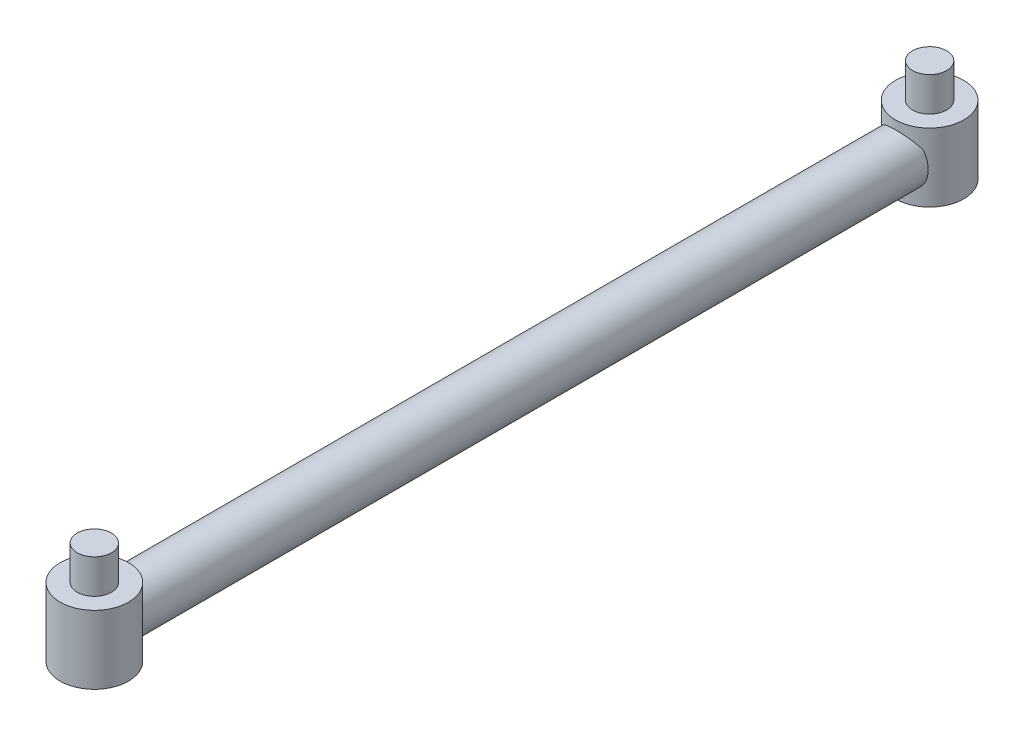
ISO-10303-21;
HEADER;
FILE_DESCRIPTION(('STEP AP214'),'2;1');
FILE_NAME('part.step','',(''),(''),'','','');
FILE_SCHEMA(('AUTOMOTIVE_DESIGN { 1 0 10303 214 1 1 1 1 }'));
ENDSEC;
DATA;
#1=APPLICATION_CONTEXT('core data for automotive mechanical design processes');
#2=APPLICATION_PROTOCOL_DEFINITION('international standard','automotive_design',2000,#1);
#3=PRODUCT_CONTEXT('',#1,'mechanical');
#4=PRODUCT('Part','Part','',(#3));
#5=PRODUCT_RELATED_PRODUCT_CATEGORY('part','',(#4));
#6=PRODUCT_DEFINITION_FORMATION('','',#4);
#7=PRODUCT_DEFINITION_CONTEXT('part definition',#1,'design');
#8=PRODUCT_DEFINITION('design','',#6,#7);
#9=PRODUCT_DEFINITION_SHAPE('','',#8);
#10=(LENGTH_UNIT() NAMED_UNIT(*) SI_UNIT(.MILLI.,.METRE.));
#11=(NAMED_UNIT(*) PLANE_ANGLE_UNIT() SI_UNIT($,.RADIAN.));
#12=(NAMED_UNIT(*) SI_UNIT($,.STERADIAN.) SOLID_ANGLE_UNIT());
#13=UNCERTAINTY_MEASURE_WITH_UNIT(LENGTH_MEASURE(1.E-05),#10,'distance_accuracy_value','');
#14=(GEOMETRIC_REPRESENTATION_CONTEXT(3) GLOBAL_UNCERTAINTY_ASSIGNED_CONTEXT((#13)) GLOBAL_UNIT_ASSIGNED_CONTEXT((#10,
#11,#12)) REPRESENTATION_CONTEXT('',''));
#15=CARTESIAN_POINT('',(0.,0.,0.));
#16=DIRECTION('',(0.,0.,1.));
#17=DIRECTION('',(1.,0.,0.));
#18=AXIS2_PLACEMENT_3D('',#15,#16,#17);
#19=CARTESIAN_POINT('',(0.,0.,0.));
#20=DIRECTION('',(0.,0.,1.));
#21=DIRECTION('',(1.,0.,0.));
#22=AXIS2_PLACEMENT_3D('',#19,#20,#21);
#23=PLANE('',#22);
#24=CARTESIAN_POINT('',(0.,0.,0.));
#25=DIRECTION('',(0.,0.,1.));
#26=DIRECTION('',(1.,0.,0.));
#27=AXIS2_PLACEMENT_3D('',#24,#25,#26);
#28=CIRCLE('',#27,1.5);
#29=CARTESIAN_POINT('',(1.22385806449171,-0.867278177967484,0.));
#30=VERTEX_POINT('',#29);
#31=CARTESIAN_POINT('',(1.22385806449252,0.867278177967211,-5.97100689130873E-13));
#32=VERTEX_POINT('',#31);
#33=EDGE_CURVE('E71',#30,#32,#28,.T.);
#34=ORIENTED_EDGE('',*,*,#33,.F.);
#35=DIRECTION('',(0.,1.,0.));
#36=VECTOR('',#35,1.);
#37=CARTESIAN_POINT('',(1.22385806449171,-2.,0.));
#38=LINE('',#37,#36);
#39=EDGE_CURVE('E39',#30,#32,#38,.T.);
#40=ORIENTED_EDGE('',*,*,#39,.T.);
#41=EDGE_LOOP('',(#34,#40));
#42=FACE_BOUND('',#41,.T.);
#43=ADVANCED_FACE('F34',(#42),#23,.F.);
#44=CARTESIAN_POINT('',(0.,-2.,47.2380359702391));
#45=DIRECTION('',(0.,1.,0.));
#46=DIRECTION('',(0.,0.,1.));
#47=AXIS2_PLACEMENT_3D('',#44,#45,#46);
#48=CYLINDRICAL_SURFACE('',#47,2.);
#49=CARTESIAN_POINT('',(0.,-2.,47.2380359702391));
#50=DIRECTION('',(0.,1.,0.));
#51=DIRECTION('',(0.,0.,1.));
#52=AXIS2_PLACEMENT_3D('',#49,#50,#51);
#53=CIRCLE('',#52,2.);
#54=CARTESIAN_POINT('',(0.,-2.,49.2380359702391));
#55=VERTEX_POINT('',#54);
#56=EDGE_CURVE('E86',#55,#55,#53,.T.);
#57=ORIENTED_EDGE('',*,*,#56,.T.);
#58=EDGE_LOOP('',(#57));
#59=FACE_BOUND('',#58,.T.);
#60=CARTESIAN_POINT('',(0.,2.,47.2380359702391));
#61=DIRECTION('',(0.,1.,0.));
#62=DIRECTION('',(0.,0.,1.));
#63=AXIS2_PLACEMENT_3D('',#60,#61,#62);
#64=CIRCLE('',#63,2.);
#65=CARTESIAN_POINT('',(0.,2.,49.2380359702391));
#66=VERTEX_POINT('',#65);
#67=EDGE_CURVE('E79',#66,#66,#64,.T.);
#68=ORIENTED_EDGE('',*,*,#67,.F.);
#69=EDGE_LOOP('',(#68));
#70=FACE_BOUND('',#69,.T.);
#71=CARTESIAN_POINT('',(-1.5,0.,45.9151603147068));
#72=CARTESIAN_POINT('',(-1.49999219049447,0.0699974234256294,45.9151440697981));
#73=CARTESIAN_POINT('',(-1.4950410907442,0.140045834311918,45.9094723040849));
#74=CARTESIAN_POINT('',(-1.47578333210409,0.27732985620948,45.888129529911));
#75=CARTESIAN_POINT('',(-1.46144878565587,0.344556445019508,45.8724287185523));
#76=CARTESIAN_POINT('',(-1.42483838991846,0.473579846738377,45.8342846910704));
#77=CARTESIAN_POINT('',(-1.40267483444956,0.535438776762464,45.8119374877909));
#78=CARTESIAN_POINT('',(-1.35130655299363,0.654345454445194,45.7631714199264));
#79=CARTESIAN_POINT('',(-1.3221026780169,0.711393782469219,45.7367530475897));
#80=CARTESIAN_POINT('',(-1.25039909811054,0.832112796316594,45.6762628406276));
#81=CARTESIAN_POINT('',(-1.20639573950363,0.894667934226478,45.6417469301412));
#82=CARTESIAN_POINT('',(-1.10933596759308,1.01252546624227,45.5728243292753));
#83=CARTESIAN_POINT('',(-1.05626622282799,1.06781696482027,45.5384178768403));
#84=CARTESIAN_POINT('',(-0.929610192252514,1.18085873865547,45.4654101458766));
#85=CARTESIAN_POINT('',(-0.854047289142164,1.23680596671985,45.4273867579415));
#86=CARTESIAN_POINT('',(-0.691189714821941,1.33462220828284,45.3592078727227));
#87=CARTESIAN_POINT('',(-0.603923293836167,1.37652429746881,45.329033928438));
#88=CARTESIAN_POINT('',(-0.447869023983644,1.43320768590294,45.2876933803366));
#89=CARTESIAN_POINT('',(-0.381446049692535,1.45235709597847,45.273538861029));
#90=CARTESIAN_POINT('',(-0.245552609316541,1.48139011599675,45.2519796108635));
#91=CARTESIAN_POINT('',(-0.176084845995168,1.49128177610674,45.2445690159154));
#92=CARTESIAN_POINT('',(-0.0358650926220255,1.50122173386249,45.2371222144582));
#93=CARTESIAN_POINT('',(0.0348897591186414,1.50124445437644,45.2371051696641));
#94=CARTESIAN_POINT('',(0.175316156674039,1.49138206321971,45.2444939052084));
#95=CARTESIAN_POINT('',(0.244987447822229,1.48149465709186,45.2519014045257));
#96=CARTESIAN_POINT('',(0.378889193792654,1.45291894941013,45.2731221907949));
#97=CARTESIAN_POINT('',(0.443224268236298,1.43454367361292,45.2867073925823));
#98=CARTESIAN_POINT('',(0.567680485046399,1.39000435781776,45.3192131836689));
#99=CARTESIAN_POINT('',(0.627800705033637,1.36383861948684,45.3381349362971));
#100=CARTESIAN_POINT('',(0.749216921864732,1.30147038485468,45.382425510394));
#101=CARTESIAN_POINT('',(0.809935384713601,1.26448790338124,45.4082705641581));
#102=CARTESIAN_POINT('',(0.924567250548287,1.18326629602948,45.4634289454017));
#103=CARTESIAN_POINT('',(0.978474784621224,1.1390209863001,45.4927452224345));
#104=CARTESIAN_POINT('',(1.08908204283329,1.03477665117906,45.5590983115155));
#105=CARTESIAN_POINT('',(1.14424493004784,0.9733907899736,45.5965194115754));
#106=CARTESIAN_POINT('',(1.24400875556228,0.842165416378053,45.6707763874014));
#107=CARTESIAN_POINT('',(1.28860466211477,0.772321900474934,45.7076119766038));
#108=CARTESIAN_POINT('',(1.35873206411601,0.639018129754369,45.7698417102475));
#109=CARTESIAN_POINT('',(1.38628866868103,0.577012954699347,45.7960599723392));
#110=CARTESIAN_POINT('',(1.43319397108784,0.447934718580615,45.8426685576651));
#111=CARTESIAN_POINT('',(1.45256121808259,0.380873520309629,45.8630720170339));
#112=CARTESIAN_POINT('',(1.47902385350669,0.256313056001673,45.8916354640367));
#113=CARTESIAN_POINT('',(1.48779069496582,0.199552917883135,45.9014205746704));
#114=CARTESIAN_POINT('',(1.49871760619789,0.0846445338261694,45.9136800858557));
#115=CARTESIAN_POINT('',(1.50088612873265,0.0264981600971747,45.916163839656));
#116=CARTESIAN_POINT('',(1.49845270115552,-0.0894789917334012,45.9134072823341));
#117=CARTESIAN_POINT('',(1.4938482589949,-0.147309645809676,45.9081641281674));
#118=CARTESIAN_POINT('',(1.47822527271969,-0.261076152442875,45.8908237824886));
#119=CARTESIAN_POINT('',(1.46719578056394,-0.317008597948105,45.8787148929656));
#120=CARTESIAN_POINT('',(1.43413959562387,-0.446338044938873,45.843758387361));
#121=CARTESIAN_POINT('',(1.40954189769242,-0.518435953915031,45.8185877332659));
#122=CARTESIAN_POINT('',(1.35088877838435,-0.656307663640119,45.7626573594393));
#123=CARTESIAN_POINT('',(1.31681594335476,-0.722069517294752,45.7318873854668));
#124=CARTESIAN_POINT('',(1.23869774116696,-0.849349008048126,45.6669531464826));
#125=CARTESIAN_POINT('',(1.19434110060341,-0.910632876218262,45.6327071317786));
#126=CARTESIAN_POINT('',(1.09682562914592,-1.02600209636125,45.5645609075154));
#127=CARTESIAN_POINT('',(1.04366252194463,-1.08008392798894,45.5306608744924));
#128=CARTESIAN_POINT('',(0.916234513829615,-1.19127699162937,45.4584337440037));
#129=CARTESIAN_POINT('',(0.83989627094685,-1.2464752388576,45.4207542285855));
#130=CARTESIAN_POINT('',(0.675551612651262,-1.34262073345087,45.3535049225408));
#131=CARTESIAN_POINT('',(0.587571029974847,-1.38359882458129,45.3239176097162));
#132=CARTESIAN_POINT('',(0.430755661496907,-1.43843799144687,45.2838419062153));
#133=CARTESIAN_POINT('',(0.364250057327468,-1.45675679327544,45.2702811899427));
#134=CARTESIAN_POINT('',(0.228364464964347,-1.48412879630752,45.2499333143478));
#135=CARTESIAN_POINT('',(0.158987104561937,-1.49319028154851,45.2431400991695));
#136=CARTESIAN_POINT('',(0.0191476059403933,-1.5015163909286,45.2369003030684));
#137=CARTESIAN_POINT('',(-0.051316692587093,-1.50075801734825,45.23747096805));
#138=CARTESIAN_POINT('',(-0.191009011030087,-1.48943900869876,45.2459479378009));
#139=CARTESIAN_POINT('',(-0.260236696591295,-1.47887576229252,45.2538561967955));
#140=CARTESIAN_POINT('',(-0.393521935254978,-1.44902508383276,45.2760019609871));
#141=CARTESIAN_POINT('',(-0.457671236511448,-1.42999981867845,45.2900490623103));
#142=CARTESIAN_POINT('',(-0.581661343097394,-1.38421193438106,45.3234087644877));
#143=CARTESIAN_POINT('',(-0.64150122338882,-1.35744766016908,45.3427224916152));
#144=CARTESIAN_POINT('',(-0.762547698766817,-1.29372206240403,45.3878595481327));
#145=CARTESIAN_POINT('',(-0.823141236713421,-1.25594906864041,45.4141724431632));
#146=CARTESIAN_POINT('',(-0.937414811724218,-1.17313355944579,45.4701809094819));
#147=CARTESIAN_POINT('',(-0.991088412383378,-1.12808436271395,45.4998795822825));
#148=CARTESIAN_POINT('',(-1.10112380660682,-1.0219946334392,45.566972439818));
#149=CARTESIAN_POINT('',(-1.15591691541996,-0.959553600560088,45.6047267451921));
#150=CARTESIAN_POINT('',(-1.25475253429351,-0.826131928100118,45.6793751456057));
#151=CARTESIAN_POINT('',(-1.29879110556729,-0.755148173963429,45.7162689210201));
#152=CARTESIAN_POINT('',(-1.36695971301455,-0.621116749409687,45.7775399557462));
#153=CARTESIAN_POINT('',(-1.39333526337998,-0.559665017293436,45.8028997201627));
#154=CARTESIAN_POINT('',(-1.43805398028599,-0.431917086944114,45.8477103237267));
#155=CARTESIAN_POINT('',(-1.45641847678344,-0.365634308404543,45.8671768112421));
#156=CARTESIAN_POINT('',(-1.4799705775638,-0.249211780403065,45.8927117364064));
#157=CARTESIAN_POINT('',(-1.48744249026867,-0.200032928709532,45.9010346675823));
#158=CARTESIAN_POINT('',(-1.49745839072448,-0.100577666966344,45.9122630163145));
#159=CARTESIAN_POINT('',(-1.50000561211714,-0.0503019990562725,45.9151719887276));
#160=CARTESIAN_POINT('',(-1.5,0.,45.9151603147068));
#161=B_SPLINE_CURVE_WITH_KNOTS('',3,(#71,#72,#73,#74,#75,#76,#77,#78,#79,#80,#81,#82,#83,#84,
#85,#86,#87,#88,#89,#90,#91,#92,#93,#94,#95,#96,#97,#98,#99,#100,#101,#102,#103,#104,#105,#106,
#107,#108,#109,#110,#111,#112,#113,#114,#115,#116,#117,#118,#119,#120,#121,#122,#123,#124,#125,
#126,#127,#128,#129,#130,#131,#132,#133,#134,#135,#136,#137,#138,#139,#140,#141,#142,#143,#144,
#145,#146,#147,#148,#149,#150,#151,#152,#153,#154,#155,#156,#157,#158,#159,#160),.UNSPECIFIED.,
.T.,.F.,(4,2,2,2,2,2,2,2,2,2,2,2,2,2,2,2,2,2,2,2,2,2,2,2,2,2,2,2,2,2,2,2,2,2,2,2,2,2,2,2,2,2,2,
2,4),(0.,0.20973177668449,0.420089722582994,0.627545385620138,0.834975984672346,
1.08585208691169,1.33710031031849,1.63964848103538,1.94147907444963,2.15227725277555,
2.36289195870711,2.57405250727807,2.78526195641288,2.9892375589505,3.19325766108669,
3.41936844116895,3.64567274887663,3.91649517204702,4.18744629647933,4.40499409477197,
4.62204646613006,4.79608005545901,4.96989060538193,5.14376512326213,5.31793678696019,
5.55730028202397,5.79710662639151,6.04543209090061,6.29387849446619,6.59652499511463,
6.89851088586565,7.10852896194427,7.31835893539181,7.52868041101044,7.73905791773945,
7.94332812691913,8.14764205379333,8.3751005248961,8.60276905744645,8.87547580578156,
9.14828228208532,9.36218279640836,9.57551025772699,9.72632812073767,9.87704692032409),.UNSPECIFIED.);
#162=CARTESIAN_POINT('',(-1.5,0.,45.9151603147068));
#163=VERTEX_POINT('',#162);
#164=EDGE_CURVE('E76',#163,#163,#161,.T.);
#165=ORIENTED_EDGE('',*,*,#164,.F.);
#166=EDGE_LOOP('',(#165));
#167=FACE_BOUND('',#166,.T.);
#168=ADVANCED_FACE('F87',(#59,#70,#167),#48,.T.);
#169=CARTESIAN_POINT('',(0.,-2.,47.2380359702391));
#170=DIRECTION('',(0.,1.,0.));
#171=DIRECTION('',(0.,0.,1.));
#172=AXIS2_PLACEMENT_3D('',#169,#170,#171);
#173=PLANE('',#172);
#174=ORIENTED_EDGE('',*,*,#56,.F.);
#175=EDGE_LOOP('',(#174));
#176=FACE_BOUND('',#175,.T.);
#177=ADVANCED_FACE('F91',(#176),#173,.F.);
#178=CARTESIAN_POINT('',(0.,2.,47.2380359702391));
#179=DIRECTION('',(0.,1.,0.));
#180=DIRECTION('',(0.,0.,1.));
#181=AXIS2_PLACEMENT_3D('',#178,#179,#180);
#182=PLANE('',#181);
#183=CARTESIAN_POINT('',(0.,2.,47.2380359702391));
#184=DIRECTION('',(0.,1.,0.));
#185=DIRECTION('',(0.,0.,1.));
#186=AXIS2_PLACEMENT_3D('',#183,#184,#185);
#187=CIRCLE('',#186,1.);
#188=CARTESIAN_POINT('',(0.,2.,48.2380359702391));
#189=VERTEX_POINT('',#188);
#190=EDGE_CURVE('E44',#189,#189,#187,.T.);
#191=ORIENTED_EDGE('',*,*,#190,.F.);
#192=EDGE_LOOP('',(#191));
#193=FACE_BOUND('',#192,.T.);
#194=ORIENTED_EDGE('',*,*,#67,.T.);
#195=EDGE_LOOP('',(#194));
#196=FACE_BOUND('',#195,.T.);
#197=ADVANCED_FACE('F93',(#193,#196),#182,.T.);
#198=CARTESIAN_POINT('',(0.,0.,46.));
#199=DIRECTION('',(0.,0.,-1.));
#200=DIRECTION('',(-1.,0.,0.));
#201=AXIS2_PLACEMENT_3D('',#198,#199,#200);
#202=CYLINDRICAL_SURFACE('',#201,1.5);
#203=ORIENTED_EDGE('',*,*,#164,.T.);
#204=EDGE_LOOP('',(#203));
#205=FACE_BOUND('',#204,.T.);
#206=CARTESIAN_POINT('',(-1.22385806449171,0.867278177967485,0.));
#207=VERTEX_POINT('',#206);
#208=CARTESIAN_POINT('',(-1.22385806449171,-0.867278177967485,0.));
#209=VERTEX_POINT('',#208);
#210=EDGE_CURVE('E67',#207,#209,#28,.T.);
#211=ORIENTED_EDGE('',*,*,#210,.T.);
#212=CARTESIAN_POINT('',(-1.5,0.,-0.258949694491724));
#213=CARTESIAN_POINT('',(-1.49999219049447,-0.0699974234256293,-0.258933449583069));
#214=CARTESIAN_POINT('',(-1.4950410907442,-0.140045834311918,-0.253261683869851));
#215=CARTESIAN_POINT('',(-1.47578333210409,-0.27732985620948,-0.231918909696));
#216=CARTESIAN_POINT('',(-1.46144878565587,-0.344556445019508,-0.216218098337312));
#217=CARTESIAN_POINT('',(-1.42483838991846,-0.473579846738376,-0.178074070855311));
#218=CARTESIAN_POINT('',(-1.40267483444956,-0.535438776762464,-0.155726867575875));
#219=CARTESIAN_POINT('',(-1.35130655299363,-0.654345454445194,-0.106960799711345));
#220=CARTESIAN_POINT('',(-1.3221026780169,-0.711393782469218,-0.0805424273746976));
#221=CARTESIAN_POINT('',(-1.25039909811054,-0.832112796316593,-0.0200522204125482));
#222=CARTESIAN_POINT('',(-1.20639573950363,-0.894667934226477,0.0144636900738546));
#223=CARTESIAN_POINT('',(-1.10933596759308,-1.01252546624227,0.083386290939769));
#224=CARTESIAN_POINT('',(-1.05626622282799,-1.06781696482027,0.117792743374749));
#225=CARTESIAN_POINT('',(-0.929610192252514,-1.18085873865547,0.190800474338491));
#226=CARTESIAN_POINT('',(-0.854047289142163,-1.23680596671986,0.22882386227357));
#227=CARTESIAN_POINT('',(-0.69118971482194,-1.33462220828284,0.297002747492305));
#228=CARTESIAN_POINT('',(-0.603923293836167,-1.37652429746881,0.327176691777046));
#229=CARTESIAN_POINT('',(-0.447869023983645,-1.43320768590294,0.368517239878465));
#230=CARTESIAN_POINT('',(-0.381446049692536,-1.45235709597847,0.382671759186048));
#231=CARTESIAN_POINT('',(-0.245552609316542,-1.48139011599675,0.404231009351533));
#232=CARTESIAN_POINT('',(-0.176084845995169,-1.49128177610674,0.411641604299623));
#233=CARTESIAN_POINT('',(-0.0358650926220279,-1.50122173386249,0.419088405756851));
#234=CARTESIAN_POINT('',(0.0348897591186387,-1.50124445437644,0.419105450550939));
#235=CARTESIAN_POINT('',(0.175316156674036,-1.49138206321971,0.411716715006643));
#236=CARTESIAN_POINT('',(0.244987447822227,-1.48149465709186,0.404309215689358));
#237=CARTESIAN_POINT('',(0.378889193792651,-1.45291894941013,0.383088429420097));
#238=CARTESIAN_POINT('',(0.443224268236295,-1.43454367361292,0.369503227632784));
#239=CARTESIAN_POINT('',(0.567680485046396,-1.39000435781776,0.336997436546152));
#240=CARTESIAN_POINT('',(0.627800705033635,-1.36383861948684,0.318075683917919));
#241=CARTESIAN_POINT('',(0.74921692186473,-1.30147038485469,0.273785109821028));
#242=CARTESIAN_POINT('',(0.809935384713598,-1.26448790338124,0.247940056056957));
#243=CARTESIAN_POINT('',(0.924567250548283,-1.18326629602949,0.192781674813374));
#244=CARTESIAN_POINT('',(0.97847478462122,-1.1390209863001,0.163465397780519));
#245=CARTESIAN_POINT('',(1.08908204283329,-1.03477665117906,0.0971123086995827));
#246=CARTESIAN_POINT('',(1.14424493004784,-0.973390789973603,0.0596912086396656));
#247=CARTESIAN_POINT('',(1.24400875556228,-0.842165416378057,-0.0145657671863198));
#248=CARTESIAN_POINT('',(1.28860466211477,-0.772321900474938,-0.0514013563887796));
#249=CARTESIAN_POINT('',(1.358732064116,-0.639018129754373,-0.113631090032422));
#250=CARTESIAN_POINT('',(1.38628866868102,-0.577012954699351,-0.139849352124188));
#251=CARTESIAN_POINT('',(1.43319397108784,-0.447934718580619,-0.186457937450075));
#252=CARTESIAN_POINT('',(1.45256121808259,-0.380873520309634,-0.206861396818903));
#253=CARTESIAN_POINT('',(1.47902385350669,-0.256313056001679,-0.235424843821694));
#254=CARTESIAN_POINT('',(1.48779069496582,-0.19955291788314,-0.245209954455313));
#255=CARTESIAN_POINT('',(1.49871760619789,-0.0846445338261743,-0.257469465640675));
#256=CARTESIAN_POINT('',(1.50088612873265,-0.0264981600971796,-0.259953219440942));
#257=CARTESIAN_POINT('',(1.49845270115552,0.0894789917333967,-0.257196662119044));
#258=CARTESIAN_POINT('',(1.4938482589949,0.147309645809671,-0.251953507952376));
#259=CARTESIAN_POINT('',(1.47822527271969,0.261076152442871,-0.234613162273553));
#260=CARTESIAN_POINT('',(1.46719578056394,0.317008597948101,-0.222504272750563));
#261=CARTESIAN_POINT('',(1.43413959562387,0.44633804493887,-0.187547767145997));
#262=CARTESIAN_POINT('',(1.40954189769242,0.518435953915029,-0.162377113050863));
#263=CARTESIAN_POINT('',(1.35088877838435,0.656307663640115,-0.106446739224261));
#264=CARTESIAN_POINT('',(1.31681594335477,0.722069517294747,-0.0756767652517152));
#265=CARTESIAN_POINT('',(1.23869774116696,0.84934900804812,-0.0107425262675194));
#266=CARTESIAN_POINT('',(1.19434110060341,0.910632876218255,0.0235034884364408));
#267=CARTESIAN_POINT('',(1.09682562914592,1.02600209636125,0.0916497126995944));
#268=CARTESIAN_POINT('',(1.04366252194463,1.08008392798894,0.125549745722634));
#269=CARTESIAN_POINT('',(0.916234513829621,1.19127699162936,0.197776876211309));
#270=CARTESIAN_POINT('',(0.839896270946856,1.2464752388576,0.235456391629551));
#271=CARTESIAN_POINT('',(0.675551612651267,1.34262073345087,0.302705697674239));
#272=CARTESIAN_POINT('',(0.587571029974851,1.38359882458129,0.332293010498819));
#273=CARTESIAN_POINT('',(0.43075566149691,1.43843799144687,0.37236871399978));
#274=CARTESIAN_POINT('',(0.364250057327472,1.45675679327544,0.385929430272381));
#275=CARTESIAN_POINT('',(0.228364464964352,1.48412879630752,0.406277305867214));
#276=CARTESIAN_POINT('',(0.158987104561943,1.49319028154851,0.413070521045584));
#277=CARTESIAN_POINT('',(0.019147605940399,1.5015163909286,0.41931031714661));
#278=CARTESIAN_POINT('',(-0.0513166925870873,1.50075801734825,0.418739652165053));
#279=CARTESIAN_POINT('',(-0.19100901103008,1.48943900869876,0.410262682414087));
#280=CARTESIAN_POINT('',(-0.260236696591288,1.47887576229252,0.402354423419493));
#281=CARTESIAN_POINT('',(-0.393521935254971,1.44902508383276,0.380208659227936));
#282=CARTESIAN_POINT('',(-0.457671236511441,1.42999981867845,0.366161557904773));
#283=CARTESIAN_POINT('',(-0.581661343097389,1.38421193438106,0.332801855727347));
#284=CARTESIAN_POINT('',(-0.641501223388814,1.35744766016909,0.313488128599847));
#285=CARTESIAN_POINT('',(-0.762547698766812,1.29372206240403,0.268351072082389));
#286=CARTESIAN_POINT('',(-0.823141236713417,1.25594906864041,0.242038177051794));
#287=CARTESIAN_POINT('',(-0.937414811724214,1.17313355944579,0.186029710733152));
#288=CARTESIAN_POINT('',(-0.991088412383373,1.12808436271395,0.156331037932564));
#289=CARTESIAN_POINT('',(-1.10112380660681,1.02199463343921,0.089238180397047));
#290=CARTESIAN_POINT('',(-1.15591691541995,0.959553600560097,0.0514838750229557));
#291=CARTESIAN_POINT('',(-1.2547525342935,0.826131928100126,-0.023164525390693));
#292=CARTESIAN_POINT('',(-1.29879110556729,0.755148173963436,-0.0600583008050978));
#293=CARTESIAN_POINT('',(-1.36695971301455,0.621116749409694,-0.121329335531171));
#294=CARTESIAN_POINT('',(-1.39333526337998,0.559665017293443,-0.146689099947648));
#295=CARTESIAN_POINT('',(-1.43805398028599,0.431917086944119,-0.19149970351169));
#296=CARTESIAN_POINT('',(-1.45641847678344,0.365634308404548,-0.210966191027056));
#297=CARTESIAN_POINT('',(-1.4799705775638,0.249211780403069,-0.236501116191396));
#298=CARTESIAN_POINT('',(-1.48744249026867,0.200032928709534,-0.24482404736722));
#299=CARTESIAN_POINT('',(-1.49745839072448,0.100577666966345,-0.256052396099471));
#300=CARTESIAN_POINT('',(-1.50000561211714,0.0503019990562731,-0.258961368512564));
#301=CARTESIAN_POINT('',(-1.5,0.,-0.258949694491724));
#302=B_SPLINE_CURVE_WITH_KNOTS('',3,(#212,#213,#214,#215,#216,#217,#218,#219,#220,#221,#222,
#223,#224,#225,#226,#227,#228,#229,#230,#231,#232,#233,#234,#235,#236,#237,#238,#239,#240,#241,
#242,#243,#244,#245,#246,#247,#248,#249,#250,#251,#252,#253,#254,#255,#256,#257,#258,#259,#260,
#261,#262,#263,#264,#265,#266,#267,#268,#269,#270,#271,#272,#273,#274,#275,#276,#277,#278,#279,
#280,#281,#282,#283,#284,#285,#286,#287,#288,#289,#290,#291,#292,#293,#294,#295,#296,#297,#298,
#299,#300,#301),.UNSPECIFIED.,.T.,.F.,(4,2,2,2,2,2,2,2,2,2,2,2,2,2,2,2,2,2,2,2,2,2,2,2,2,2,2,2,
2,2,2,2,2,2,2,2,2,2,2,2,2,2,2,2,4),(0.,0.20973177668449,0.420089722582994,0.627545385620139,
0.834975984672345,1.08585208691169,1.33710031031849,1.63964848103538,1.94147907444963,
2.15227725277555,2.36289195870711,2.57405250727807,2.78526195641288,2.9892375589505,
3.19325766108669,3.41936844116895,3.64567274887663,3.91649517204702,4.18744629647933,
4.40499409477196,4.62204646613006,4.79608005545901,4.96989060538193,5.14376512326213,
5.31793678696019,5.55730028202398,5.79710662639151,6.0454320909006,6.29387849446618,
6.59652499511463,6.89851088586565,7.10852896194427,7.31835893539181,7.52868041101044,
7.73905791773945,7.94332812691912,8.14764205379333,8.3751005248961,8.60276905744644,
8.87547580578155,9.14828228208531,9.36218279640835,9.57551025772699,9.72632812073767,
9.87704692032409),.UNSPECIFIED.);
#303=EDGE_CURVE('E52',#209,#30,#302,.T.);
#304=ORIENTED_EDGE('',*,*,#303,.T.);
#305=ORIENTED_EDGE('',*,*,#33,.T.);
#306=EDGE_CURVE('E63',#32,#207,#302,.T.);
#307=ORIENTED_EDGE('',*,*,#306,.T.);
#308=EDGE_LOOP('',(#211,#304,#305,#307));
#309=FACE_BOUND('',#308,.T.);
#310=ADVANCED_FACE('F36',(#205,#309),#202,.T.);
#311=ORIENTED_EDGE('',*,*,#210,.F.);
#312=DIRECTION('',(0.,1.,0.));
#313=VECTOR('',#312,1.);
#314=CARTESIAN_POINT('',(-1.22385806449171,-2.,0.));
#315=LINE('',#314,#313);
#316=EDGE_CURVE('E60',#207,#209,#315,.F.);
#317=ORIENTED_EDGE('',*,*,#316,.T.);
#318=EDGE_LOOP('',(#311,#317));
#319=FACE_BOUND('',#318,.T.);
#320=ADVANCED_FACE('F74',(#319),#23,.F.);
#321=CARTESIAN_POINT('',(0.,-2.,-1.58182535002402));
#322=DIRECTION('',(0.,1.,0.));
#323=DIRECTION('',(0.,0.,1.));
#324=AXIS2_PLACEMENT_3D('',#321,#322,#323);
#325=CYLINDRICAL_SURFACE('',#324,2.);
#326=CARTESIAN_POINT('',(0.,2.,-1.58182535002402));
#327=DIRECTION('',(0.,1.,0.));
#328=DIRECTION('',(0.,0.,1.));
#329=AXIS2_PLACEMENT_3D('',#326,#327,#328);
#330=CIRCLE('',#329,2.);
#331=CARTESIAN_POINT('',(0.,2.,0.418174649975985));
#332=VERTEX_POINT('',#331);
#333=EDGE_CURVE('E117',#332,#332,#330,.T.);
#334=ORIENTED_EDGE('',*,*,#333,.F.);
#335=EDGE_LOOP('',(#334));
#336=FACE_BOUND('',#335,.T.);
#337=CARTESIAN_POINT('',(0.,-2.,-1.58182535002402));
#338=DIRECTION('',(0.,1.,0.));
#339=DIRECTION('',(0.,0.,1.));
#340=AXIS2_PLACEMENT_3D('',#337,#338,#339);
#341=CIRCLE('',#340,2.);
#342=CARTESIAN_POINT('',(0.,-2.,0.418174649975985));
#343=VERTEX_POINT('',#342);
#344=EDGE_CURVE('E72',#343,#343,#341,.T.);
#345=ORIENTED_EDGE('',*,*,#344,.T.);
#346=EDGE_LOOP('',(#345));
#347=FACE_BOUND('',#346,.T.);
#348=ORIENTED_EDGE('',*,*,#39,.F.);
#349=ORIENTED_EDGE('',*,*,#303,.F.);
#350=ORIENTED_EDGE('',*,*,#316,.F.);
#351=ORIENTED_EDGE('',*,*,#306,.F.);
#352=EDGE_LOOP('',(#348,#349,#350,#351));
#353=FACE_BOUND('',#352,.T.);
#354=ADVANCED_FACE('F62',(#336,#347,#353),#325,.T.);
#355=CARTESIAN_POINT('',(0.,-2.,-1.58182535002402));
#356=DIRECTION('',(0.,1.,0.));
#357=DIRECTION('',(0.,0.,1.));
#358=AXIS2_PLACEMENT_3D('',#355,#356,#357);
#359=PLANE('',#358);
#360=ORIENTED_EDGE('',*,*,#344,.F.);
#361=EDGE_LOOP('',(#360));
#362=FACE_BOUND('',#361,.T.);
#363=ADVANCED_FACE('F100',(#362),#359,.F.);
#364=CARTESIAN_POINT('',(0.,2.,-1.58182535002402));
#365=DIRECTION('',(0.,1.,0.));
#366=DIRECTION('',(0.,0.,1.));
#367=AXIS2_PLACEMENT_3D('',#364,#365,#366);
#368=PLANE('',#367);
#369=CARTESIAN_POINT('',(0.,2.,-1.58182535002402));
#370=DIRECTION('',(0.,1.,0.));
#371=DIRECTION('',(0.,0.,1.));
#372=AXIS2_PLACEMENT_3D('',#369,#370,#371);
#373=CIRCLE('',#372,1.);
#374=CARTESIAN_POINT('',(0.,2.,-0.581825350024015));
#375=VERTEX_POINT('',#374);
#376=EDGE_CURVE('E11',#375,#375,#373,.T.);
#377=ORIENTED_EDGE('',*,*,#376,.F.);
#378=EDGE_LOOP('',(#377));
#379=FACE_BOUND('',#378,.T.);
#380=ORIENTED_EDGE('',*,*,#333,.T.);
#381=EDGE_LOOP('',(#380));
#382=FACE_BOUND('',#381,.T.);
#383=ADVANCED_FACE('F124',(#379,#382),#368,.T.);
#384=CARTESIAN_POINT('',(0.,4.,47.2380359702391));
#385=DIRECTION('',(0.,-1.,0.));
#386=DIRECTION('',(0.,0.,-1.));
#387=AXIS2_PLACEMENT_3D('',#384,#385,#386);
#388=CYLINDRICAL_SURFACE('',#387,1.);
#389=CARTESIAN_POINT('',(0.,4.,47.2380359702391));
#390=DIRECTION('',(0.,1.,0.));
#391=DIRECTION('',(0.,0.,1.));
#392=AXIS2_PLACEMENT_3D('',#389,#390,#391);
#393=CIRCLE('',#392,1.);
#394=CARTESIAN_POINT('',(0.,4.,48.2380359702391));
#395=VERTEX_POINT('',#394);
#396=EDGE_CURVE('E114',#395,#395,#393,.T.);
#397=ORIENTED_EDGE('',*,*,#396,.F.);
#398=EDGE_LOOP('',(#397));
#399=FACE_BOUND('',#398,.T.);
#400=ORIENTED_EDGE('',*,*,#190,.T.);
#401=EDGE_LOOP('',(#400));
#402=FACE_BOUND('',#401,.T.);
#403=ADVANCED_FACE('F177',(#399,#402),#388,.T.);
#404=CARTESIAN_POINT('',(0.,4.,47.2380359702391));
#405=DIRECTION('',(0.,1.,0.));
#406=DIRECTION('',(0.,0.,1.));
#407=AXIS2_PLACEMENT_3D('',#404,#405,#406);
#408=PLANE('',#407);
#409=ORIENTED_EDGE('',*,*,#396,.T.);
#410=EDGE_LOOP('',(#409));
#411=FACE_BOUND('',#410,.T.);
#412=ADVANCED_FACE('F183',(#411),#408,.T.);
#413=CARTESIAN_POINT('',(0.,4.,-1.58182535002402));
#414=DIRECTION('',(0.,-1.,0.));
#415=DIRECTION('',(0.,0.,-1.));
#416=AXIS2_PLACEMENT_3D('',#413,#414,#415);
#417=CYLINDRICAL_SURFACE('',#416,1.);
#418=CARTESIAN_POINT('',(0.,4.,-1.58182535002402));
#419=DIRECTION('',(0.,1.,0.));
#420=DIRECTION('',(0.,0.,1.));
#421=AXIS2_PLACEMENT_3D('',#418,#419,#420);
#422=CIRCLE('',#421,1.);
#423=CARTESIAN_POINT('',(0.,4.,-0.581825350024015));
#424=VERTEX_POINT('',#423);
#425=EDGE_CURVE('E222',#424,#424,#422,.T.);
#426=ORIENTED_EDGE('',*,*,#425,.F.);
#427=EDGE_LOOP('',(#426));
#428=FACE_BOUND('',#427,.T.);
#429=ORIENTED_EDGE('',*,*,#376,.T.);
#430=EDGE_LOOP('',(#429));
#431=FACE_BOUND('',#430,.T.);
#432=ADVANCED_FACE('F191',(#428,#431),#417,.T.);
#433=CARTESIAN_POINT('',(0.,4.,-1.58182535002402));
#434=DIRECTION('',(0.,1.,0.));
#435=DIRECTION('',(0.,0.,1.));
#436=AXIS2_PLACEMENT_3D('',#433,#434,#435);
#437=PLANE('',#436);
#438=ORIENTED_EDGE('',*,*,#425,.T.);
#439=EDGE_LOOP('',(#438));
#440=FACE_BOUND('',#439,.T.);
#441=ADVANCED_FACE('F199',(#440),#437,.T.);
#442=CLOSED_SHELL('',(#43,#168,#177,#197,#310,#320,#354,#363,#383,#403,#412,#432,#441));
#443=MANIFOLD_SOLID_BREP('B2',#442);
#444=ADVANCED_BREP_SHAPE_REPRESENTATION('',(#18,#443),#14);
#445=SHAPE_DEFINITION_REPRESENTATION(#9,#444);
ENDSEC;
END-ISO-10303-21;
